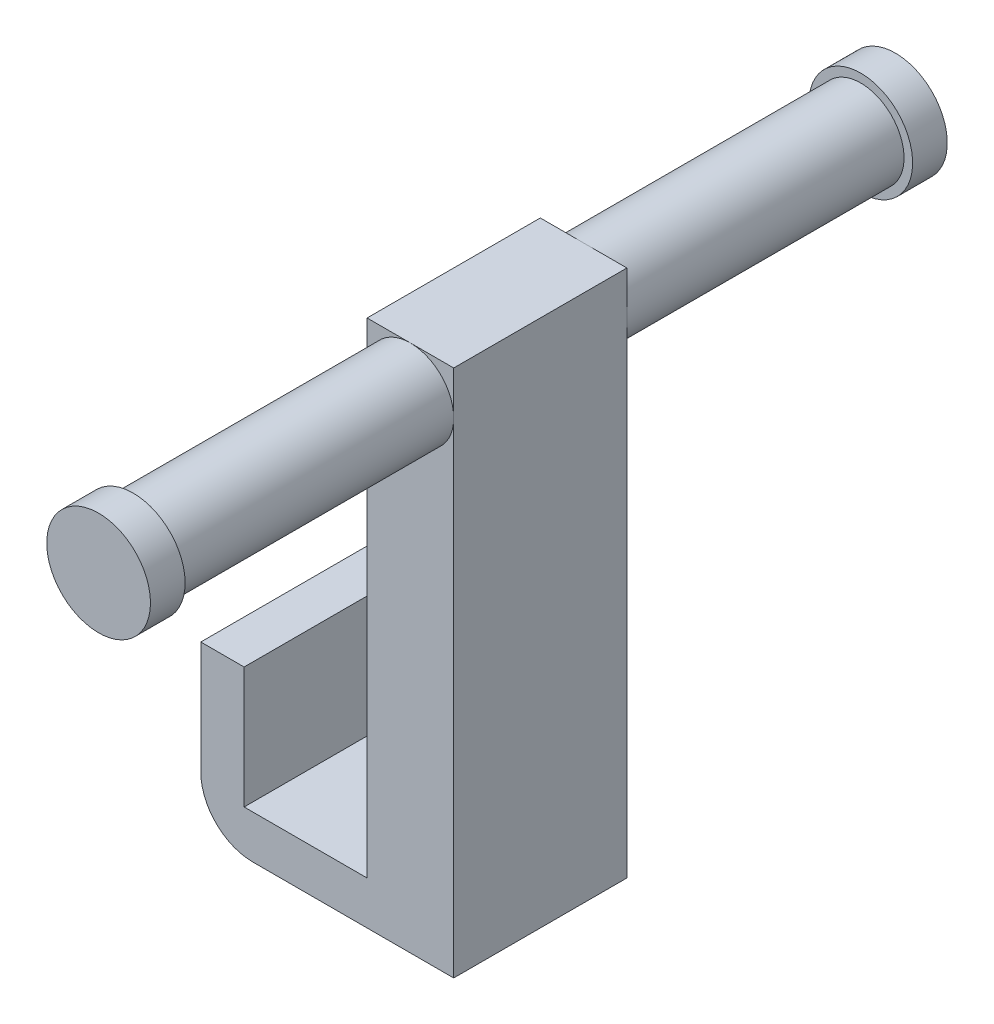
ISO-10303-21;
HEADER;
FILE_DESCRIPTION(('STEP AP214'),'2;1');
FILE_NAME('part.step','',(''),(''),'','','');
FILE_SCHEMA(('AUTOMOTIVE_DESIGN { 1 0 10303 214 1 1 1 1 }'));
ENDSEC;
DATA;
#1=APPLICATION_CONTEXT('core data for automotive mechanical design processes');
#2=APPLICATION_PROTOCOL_DEFINITION('international standard','automotive_design',2000,#1);
#3=PRODUCT_CONTEXT('',#1,'mechanical');
#4=PRODUCT('Part','Part','',(#3));
#5=PRODUCT_RELATED_PRODUCT_CATEGORY('part','',(#4));
#6=PRODUCT_DEFINITION_FORMATION('','',#4);
#7=PRODUCT_DEFINITION_CONTEXT('part definition',#1,'design');
#8=PRODUCT_DEFINITION('design','',#6,#7);
#9=PRODUCT_DEFINITION_SHAPE('','',#8);
#10=(LENGTH_UNIT() NAMED_UNIT(*) SI_UNIT(.MILLI.,.METRE.));
#11=(NAMED_UNIT(*) PLANE_ANGLE_UNIT() SI_UNIT($,.RADIAN.));
#12=(NAMED_UNIT(*) SI_UNIT($,.STERADIAN.) SOLID_ANGLE_UNIT());
#13=UNCERTAINTY_MEASURE_WITH_UNIT(LENGTH_MEASURE(1.E-05),#10,'distance_accuracy_value','');
#14=(GEOMETRIC_REPRESENTATION_CONTEXT(3) GLOBAL_UNCERTAINTY_ASSIGNED_CONTEXT((#13)) GLOBAL_UNIT_ASSIGNED_CONTEXT((#10,
#11,#12)) REPRESENTATION_CONTEXT('',''));
#15=CARTESIAN_POINT('',(0.,0.,0.));
#16=DIRECTION('',(0.,0.,1.));
#17=DIRECTION('',(1.,0.,0.));
#18=AXIS2_PLACEMENT_3D('',#15,#16,#17);
#19=CARTESIAN_POINT('',(7.3,1.76152304609218,1.77955911823647));
#20=DIRECTION('',(0.,0.,-1.));
#21=DIRECTION('',(-1.,0.,0.));
#22=AXIS2_PLACEMENT_3D('',#19,#20,#21);
#23=PLANE('',#22);
#24=CARTESIAN_POINT('',(6.05,14.5115230460922,1.77955911823647));
#25=DIRECTION('',(0.,0.,1.));
#26=DIRECTION('',(1.,0.,0.));
#27=AXIS2_PLACEMENT_3D('',#24,#25,#26);
#28=CIRCLE('',#27,1.25);
#29=CARTESIAN_POINT('',(7.3,14.5115230460922,1.77955911823647));
#30=VERTEX_POINT('',#29);
#31=CARTESIAN_POINT('',(6.05,15.7615230460922,1.77955911823647));
#32=VERTEX_POINT('',#31);
#33=EDGE_CURVE('E148',#30,#32,#28,.T.);
#34=ORIENTED_EDGE('',*,*,#33,.F.);
#35=DIRECTION('',(0.,-1.,0.));
#36=VECTOR('',#35,1.);
#37=CARTESIAN_POINT('',(7.3,1.76152304609218,1.77955911823647));
#38=LINE('',#37,#36);
#39=CARTESIAN_POINT('',(7.3,15.7615230460922,1.77955911823647));
#40=VERTEX_POINT('',#39);
#41=EDGE_CURVE('E126',#40,#30,#38,.T.);
#42=ORIENTED_EDGE('',*,*,#41,.F.);
#43=DIRECTION('',(1.,0.,0.));
#44=VECTOR('',#43,1.);
#45=CARTESIAN_POINT('',(7.3,15.7615230460922,1.77955911823647));
#46=LINE('',#45,#44);
#47=EDGE_CURVE('E149',#32,#40,#46,.T.);
#48=ORIENTED_EDGE('',*,*,#47,.F.);
#49=EDGE_LOOP('',(#34,#42,#48));
#50=FACE_BOUND('',#49,.T.);
#51=ADVANCED_FACE('F39',(#50),#23,.F.);
#52=CARTESIAN_POINT('',(4.8,14.5115230460922,1.77955911823647));
#53=VERTEX_POINT('',#52);
#54=EDGE_CURVE('E156',#32,#53,#28,.T.);
#55=ORIENTED_EDGE('',*,*,#54,.F.);
#56=CARTESIAN_POINT('',(4.8,15.7615230460922,1.77955911823647));
#57=VERTEX_POINT('',#56);
#58=EDGE_CURVE('E185',#57,#32,#46,.T.);
#59=ORIENTED_EDGE('',*,*,#58,.F.);
#60=DIRECTION('',(0.,-1.,0.));
#61=VECTOR('',#60,1.);
#62=CARTESIAN_POINT('',(4.8,15.7615230460922,1.77955911823647));
#63=LINE('',#62,#61);
#64=EDGE_CURVE('E190',#57,#53,#63,.T.);
#65=ORIENTED_EDGE('',*,*,#64,.T.);
#66=EDGE_LOOP('',(#55,#59,#65));
#67=FACE_BOUND('',#66,.T.);
#68=ADVANCED_FACE('F259',(#67),#23,.F.);
#69=CARTESIAN_POINT('',(7.3,1.76152304609218,-3.22044088176353));
#70=DIRECTION('',(0.,0.,1.));
#71=DIRECTION('',(1.,0.,0.));
#72=AXIS2_PLACEMENT_3D('',#69,#70,#71);
#73=PLANE('',#72);
#74=CARTESIAN_POINT('',(6.05,14.5115230460922,-3.22044088176353));
#75=DIRECTION('',(0.,0.,-1.));
#76=DIRECTION('',(-1.,0.,0.));
#77=AXIS2_PLACEMENT_3D('',#74,#75,#76);
#78=CIRCLE('',#77,1.25);
#79=CARTESIAN_POINT('',(4.8,14.5115230460922,-3.22044088176353));
#80=VERTEX_POINT('',#79);
#81=CARTESIAN_POINT('',(6.05,15.7615230460922,-3.22044088176353));
#82=VERTEX_POINT('',#81);
#83=EDGE_CURVE('E163',#80,#82,#78,.T.);
#84=ORIENTED_EDGE('',*,*,#83,.F.);
#85=DIRECTION('',(0.,-1.,0.));
#86=VECTOR('',#85,1.);
#87=CARTESIAN_POINT('',(4.8,15.7615230460922,-3.22044088176353));
#88=LINE('',#87,#86);
#89=CARTESIAN_POINT('',(4.8,15.7615230460922,-3.22044088176353));
#90=VERTEX_POINT('',#89);
#91=EDGE_CURVE('E194',#90,#80,#88,.T.);
#92=ORIENTED_EDGE('',*,*,#91,.F.);
#93=DIRECTION('',(-1.,0.,0.));
#94=VECTOR('',#93,1.);
#95=CARTESIAN_POINT('',(7.3,15.7615230460922,-3.22044088176353));
#96=LINE('',#95,#94);
#97=EDGE_CURVE('E179',#82,#90,#96,.T.);
#98=ORIENTED_EDGE('',*,*,#97,.F.);
#99=EDGE_LOOP('',(#84,#92,#98));
#100=FACE_BOUND('',#99,.T.);
#101=ADVANCED_FACE('F252',(#100),#73,.F.);
#102=CARTESIAN_POINT('',(7.3,14.5115230460922,-3.22044088176353));
#103=VERTEX_POINT('',#102);
#104=EDGE_CURVE('E158',#82,#103,#78,.T.);
#105=ORIENTED_EDGE('',*,*,#104,.F.);
#106=CARTESIAN_POINT('',(7.3,15.7615230460922,-3.22044088176353));
#107=VERTEX_POINT('',#106);
#108=EDGE_CURVE('E180',#107,#82,#96,.T.);
#109=ORIENTED_EDGE('',*,*,#108,.F.);
#110=DIRECTION('',(0.,1.,0.));
#111=VECTOR('',#110,1.);
#112=CARTESIAN_POINT('',(7.3,1.76152304609218,-3.22044088176353));
#113=LINE('',#112,#111);
#114=EDGE_CURVE('E217',#103,#107,#113,.T.);
#115=ORIENTED_EDGE('',*,*,#114,.F.);
#116=EDGE_LOOP('',(#105,#109,#115));
#117=FACE_BOUND('',#116,.T.);
#118=ADVANCED_FACE('F249',(#117),#73,.F.);
#119=CARTESIAN_POINT('',(7.3,1.76152304609218,1.77955911823647));
#120=DIRECTION('',(0.,-1.,0.));
#121=DIRECTION('',(0.,0.,-1.));
#122=AXIS2_PLACEMENT_3D('',#119,#120,#121);
#123=PLANE('',#122);
#124=DIRECTION('',(0.,0.,1.));
#125=VECTOR('',#124,1.);
#126=CARTESIAN_POINT('',(4.8,1.76152304609218,-3.22044088176353));
#127=LINE('',#126,#125);
#128=CARTESIAN_POINT('',(4.8,1.76152304609218,-3.22044088176353));
#129=VERTEX_POINT('',#128);
#130=CARTESIAN_POINT('',(4.8,1.76152304609218,1.77955911823647));
#131=VERTEX_POINT('',#130);
#132=EDGE_CURVE('E175',#129,#131,#127,.T.);
#133=ORIENTED_EDGE('',*,*,#132,.F.);
#134=DIRECTION('',(-1.,0.,0.));
#135=VECTOR('',#134,1.);
#136=CARTESIAN_POINT('',(7.3,1.76152304609218,-3.22044088176353));
#137=LINE('',#136,#135);
#138=CARTESIAN_POINT('',(1.25,1.76152304609218,-3.22044088176353));
#139=VERTEX_POINT('',#138);
#140=EDGE_CURVE('E225',#129,#139,#137,.T.);
#141=ORIENTED_EDGE('',*,*,#140,.T.);
#142=DIRECTION('',(0.,0.,-1.));
#143=VECTOR('',#142,1.);
#144=CARTESIAN_POINT('',(1.25,1.76152304609218,-3.22044088176353));
#145=LINE('',#144,#143);
#146=CARTESIAN_POINT('',(1.25,1.76152304609218,1.77955911823647));
#147=VERTEX_POINT('',#146);
#148=EDGE_CURVE('E196',#147,#139,#145,.T.);
#149=ORIENTED_EDGE('',*,*,#148,.F.);
#150=DIRECTION('',(-1.,0.,0.));
#151=VECTOR('',#150,1.);
#152=CARTESIAN_POINT('',(7.3,1.76152304609218,1.77955911823647));
#153=LINE('',#152,#151);
#154=EDGE_CURVE('E221',#131,#147,#153,.T.);
#155=ORIENTED_EDGE('',*,*,#154,.F.);
#156=EDGE_LOOP('',(#133,#141,#149,#155));
#157=FACE_BOUND('',#156,.T.);
#158=ADVANCED_FACE('F269',(#157),#123,.F.);
#159=DIRECTION('',(0.,-1.,0.));
#160=VECTOR('',#159,1.);
#161=CARTESIAN_POINT('',(0.,1.76152304609218,1.77955911823647));
#162=LINE('',#161,#160);
#163=CARTESIAN_POINT('',(0.,5.26152304609218,1.77955911823647));
#164=VERTEX_POINT('',#163);
#165=CARTESIAN_POINT('',(0.,2.01152304609218,1.77955911823647));
#166=VERTEX_POINT('',#165);
#167=EDGE_CURVE('E214',#164,#166,#162,.T.);
#168=ORIENTED_EDGE('',*,*,#167,.T.);
#169=CARTESIAN_POINT('',(1.5,2.01152304609218,1.77955911823647));
#170=DIRECTION('',(0.,0.,-1.));
#171=DIRECTION('',(-1.,0.,0.));
#172=AXIS2_PLACEMENT_3D('',#169,#170,#171);
#173=CIRCLE('',#172,1.5);
#174=CARTESIAN_POINT('',(1.5,0.511523046092185,1.77955911823647));
#175=VERTEX_POINT('',#174);
#176=EDGE_CURVE('E11',#166,#175,#173,.F.);
#177=ORIENTED_EDGE('',*,*,#176,.T.);
#178=DIRECTION('',(-1.,0.,0.));
#179=VECTOR('',#178,1.);
#180=CARTESIAN_POINT('',(7.3,0.511523046092185,1.77955911823647));
#181=LINE('',#180,#179);
#182=CARTESIAN_POINT('',(7.3,0.511523046092185,1.77955911823647));
#183=VERTEX_POINT('',#182);
#184=EDGE_CURVE('E145',#183,#175,#181,.T.);
#185=ORIENTED_EDGE('',*,*,#184,.F.);
#186=EDGE_CURVE('E129',#30,#183,#38,.T.);
#187=ORIENTED_EDGE('',*,*,#186,.F.);
#188=EDGE_CURVE('E142',#53,#30,#28,.T.);
#189=ORIENTED_EDGE('',*,*,#188,.F.);
#190=EDGE_CURVE('E187',#53,#131,#63,.T.);
#191=ORIENTED_EDGE('',*,*,#190,.T.);
#192=ORIENTED_EDGE('',*,*,#154,.T.);
#193=DIRECTION('',(0.,-1.,0.));
#194=VECTOR('',#193,1.);
#195=CARTESIAN_POINT('',(1.25,5.26152304609218,1.77955911823647));
#196=LINE('',#195,#194);
#197=CARTESIAN_POINT('',(1.25,5.26152304609218,1.77955911823647));
#198=VERTEX_POINT('',#197);
#199=EDGE_CURVE('E212',#198,#147,#196,.T.);
#200=ORIENTED_EDGE('',*,*,#199,.F.);
#201=DIRECTION('',(1.,0.,0.));
#202=VECTOR('',#201,1.);
#203=CARTESIAN_POINT('',(0.,5.26152304609218,1.77955911823647));
#204=LINE('',#203,#202);
#205=EDGE_CURVE('E200',#164,#198,#204,.T.);
#206=ORIENTED_EDGE('',*,*,#205,.F.);
#207=EDGE_LOOP('',(#168,#177,#185,#187,#189,#191,#192,#200,#206));
#208=FACE_BOUND('',#207,.T.);
#209=ADVANCED_FACE('F140',(#208),#23,.F.);
#210=CARTESIAN_POINT('',(7.3,0.511523046092185,1.77955911823647));
#211=DIRECTION('',(0.,1.,0.));
#212=DIRECTION('',(0.,0.,1.));
#213=AXIS2_PLACEMENT_3D('',#210,#211,#212);
#214=PLANE('',#213);
#215=ORIENTED_EDGE('',*,*,#184,.T.);
#216=DIRECTION('',(0.,0.,-1.));
#217=VECTOR('',#216,1.);
#218=CARTESIAN_POINT('',(1.5,0.511523046092185,1.77955911823647));
#219=LINE('',#218,#217);
#220=CARTESIAN_POINT('',(1.5,0.511523046092185,-3.22044088176353));
#221=VERTEX_POINT('',#220);
#222=EDGE_CURVE('E159',#175,#221,#219,.T.);
#223=ORIENTED_EDGE('',*,*,#222,.T.);
#224=DIRECTION('',(-1.,0.,0.));
#225=VECTOR('',#224,1.);
#226=CARTESIAN_POINT('',(7.3,0.511523046092185,-3.22044088176353));
#227=LINE('',#226,#225);
#228=CARTESIAN_POINT('',(7.3,0.511523046092185,-3.22044088176353));
#229=VERTEX_POINT('',#228);
#230=EDGE_CURVE('E227',#229,#221,#227,.T.);
#231=ORIENTED_EDGE('',*,*,#230,.F.);
#232=DIRECTION('',(0.,0.,-1.));
#233=VECTOR('',#232,1.);
#234=CARTESIAN_POINT('',(7.3,0.511523046092185,1.77955911823647));
#235=LINE('',#234,#233);
#236=EDGE_CURVE('E136',#183,#229,#235,.T.);
#237=ORIENTED_EDGE('',*,*,#236,.F.);
#238=EDGE_LOOP('',(#215,#223,#231,#237));
#239=FACE_BOUND('',#238,.T.);
#240=ADVANCED_FACE('F235',(#239),#214,.F.);
#241=ORIENTED_EDGE('',*,*,#230,.T.);
#242=CARTESIAN_POINT('',(1.5,2.01152304609218,-3.22044088176353));
#243=DIRECTION('',(0.,0.,1.));
#244=DIRECTION('',(1.,0.,0.));
#245=AXIS2_PLACEMENT_3D('',#242,#243,#244);
#246=CIRCLE('',#245,1.5);
#247=CARTESIAN_POINT('',(0.,2.01152304609218,-3.22044088176353));
#248=VERTEX_POINT('',#247);
#249=EDGE_CURVE('E61',#221,#248,#246,.F.);
#250=ORIENTED_EDGE('',*,*,#249,.T.);
#251=DIRECTION('',(0.,1.,0.));
#252=VECTOR('',#251,1.);
#253=CARTESIAN_POINT('',(0.,1.76152304609218,-3.22044088176353));
#254=LINE('',#253,#252);
#255=CARTESIAN_POINT('',(0.,5.26152304609218,-3.22044088176353));
#256=VERTEX_POINT('',#255);
#257=EDGE_CURVE('E146',#248,#256,#254,.T.);
#258=ORIENTED_EDGE('',*,*,#257,.T.);
#259=DIRECTION('',(-1.,0.,0.));
#260=VECTOR('',#259,1.);
#261=CARTESIAN_POINT('',(0.,5.26152304609218,-3.22044088176353));
#262=LINE('',#261,#260);
#263=CARTESIAN_POINT('',(1.25,5.26152304609218,-3.22044088176353));
#264=VERTEX_POINT('',#263);
#265=EDGE_CURVE('E204',#264,#256,#262,.T.);
#266=ORIENTED_EDGE('',*,*,#265,.F.);
#267=DIRECTION('',(0.,-1.,0.));
#268=VECTOR('',#267,1.);
#269=CARTESIAN_POINT('',(1.25,5.26152304609218,-3.22044088176353));
#270=LINE('',#269,#268);
#271=EDGE_CURVE('E207',#264,#139,#270,.T.);
#272=ORIENTED_EDGE('',*,*,#271,.T.);
#273=ORIENTED_EDGE('',*,*,#140,.F.);
#274=EDGE_CURVE('E193',#80,#129,#88,.T.);
#275=ORIENTED_EDGE('',*,*,#274,.F.);
#276=EDGE_CURVE('E161',#103,#80,#78,.T.);
#277=ORIENTED_EDGE('',*,*,#276,.F.);
#278=EDGE_CURVE('E218',#229,#103,#113,.T.);
#279=ORIENTED_EDGE('',*,*,#278,.F.);
#280=EDGE_LOOP('',(#241,#250,#258,#266,#272,#273,#275,#277,#279));
#281=FACE_BOUND('',#280,.T.);
#282=ADVANCED_FACE('F239',(#281),#73,.F.);
#283=CARTESIAN_POINT('',(7.3,0.,0.));
#284=DIRECTION('',(1.,0.,0.));
#285=DIRECTION('',(0.,0.,-1.));
#286=AXIS2_PLACEMENT_3D('',#283,#284,#285);
#287=PLANE('',#286);
#288=ORIENTED_EDGE('',*,*,#41,.T.);
#289=ORIENTED_EDGE('',*,*,#186,.T.);
#290=ORIENTED_EDGE('',*,*,#236,.T.);
#291=ORIENTED_EDGE('',*,*,#278,.T.);
#292=ORIENTED_EDGE('',*,*,#114,.T.);
#293=DIRECTION('',(0.,0.,-1.));
#294=VECTOR('',#293,1.);
#295=CARTESIAN_POINT('',(7.3,15.7615230460922,-3.22044088176353));
#296=LINE('',#295,#294);
#297=EDGE_CURVE('E132',#40,#107,#296,.T.);
#298=ORIENTED_EDGE('',*,*,#297,.F.);
#299=EDGE_LOOP('',(#288,#289,#290,#291,#292,#298));
#300=FACE_BOUND('',#299,.T.);
#301=ADVANCED_FACE('F128',(#300),#287,.T.);
#302=CARTESIAN_POINT('',(0.,0.,0.));
#303=DIRECTION('',(1.,0.,0.));
#304=DIRECTION('',(0.,0.,-1.));
#305=AXIS2_PLACEMENT_3D('',#302,#303,#304);
#306=PLANE('',#305);
#307=ORIENTED_EDGE('',*,*,#257,.F.);
#308=DIRECTION('',(0.,0.,-1.));
#309=VECTOR('',#308,1.);
#310=CARTESIAN_POINT('',(0.,2.01152304609218,0.));
#311=LINE('',#310,#309);
#312=EDGE_CURVE('E47',#248,#166,#311,.F.);
#313=ORIENTED_EDGE('',*,*,#312,.T.);
#314=ORIENTED_EDGE('',*,*,#167,.F.);
#315=DIRECTION('',(0.,0.,1.));
#316=VECTOR('',#315,1.);
#317=CARTESIAN_POINT('',(0.,5.26152304609218,-3.22044088176353));
#318=LINE('',#317,#316);
#319=EDGE_CURVE('E197',#256,#164,#318,.T.);
#320=ORIENTED_EDGE('',*,*,#319,.F.);
#321=EDGE_LOOP('',(#307,#313,#314,#320));
#322=FACE_BOUND('',#321,.T.);
#323=ADVANCED_FACE('F302',(#322),#306,.F.);
#324=CARTESIAN_POINT('',(1.25,5.26152304609218,-3.22044088176353));
#325=DIRECTION('',(-1.,0.,0.));
#326=DIRECTION('',(0.,0.,1.));
#327=AXIS2_PLACEMENT_3D('',#324,#325,#326);
#328=PLANE('',#327);
#329=ORIENTED_EDGE('',*,*,#148,.T.);
#330=ORIENTED_EDGE('',*,*,#271,.F.);
#331=DIRECTION('',(0.,0.,-1.));
#332=VECTOR('',#331,1.);
#333=CARTESIAN_POINT('',(1.25,5.26152304609218,-3.22044088176353));
#334=LINE('',#333,#332);
#335=EDGE_CURVE('E202',#198,#264,#334,.T.);
#336=ORIENTED_EDGE('',*,*,#335,.F.);
#337=ORIENTED_EDGE('',*,*,#199,.T.);
#338=EDGE_LOOP('',(#329,#330,#336,#337));
#339=FACE_BOUND('',#338,.T.);
#340=ADVANCED_FACE('F273',(#339),#328,.F.);
#341=CARTESIAN_POINT('',(0.,5.26152304609218,0.));
#342=DIRECTION('',(0.,1.,0.));
#343=DIRECTION('',(0.,0.,1.));
#344=AXIS2_PLACEMENT_3D('',#341,#342,#343);
#345=PLANE('',#344);
#346=ORIENTED_EDGE('',*,*,#319,.T.);
#347=ORIENTED_EDGE('',*,*,#205,.T.);
#348=ORIENTED_EDGE('',*,*,#335,.T.);
#349=ORIENTED_EDGE('',*,*,#265,.T.);
#350=EDGE_LOOP('',(#346,#347,#348,#349));
#351=FACE_BOUND('',#350,.T.);
#352=ADVANCED_FACE('F276',(#351),#345,.T.);
#353=CARTESIAN_POINT('',(4.8,15.7615230460922,-3.22044088176353));
#354=DIRECTION('',(1.,0.,0.));
#355=DIRECTION('',(0.,0.,-1.));
#356=AXIS2_PLACEMENT_3D('',#353,#354,#355);
#357=PLANE('',#356);
#358=ORIENTED_EDGE('',*,*,#132,.T.);
#359=ORIENTED_EDGE('',*,*,#190,.F.);
#360=ORIENTED_EDGE('',*,*,#64,.F.);
#361=DIRECTION('',(0.,0.,1.));
#362=VECTOR('',#361,1.);
#363=CARTESIAN_POINT('',(4.8,15.7615230460922,-3.22044088176353));
#364=LINE('',#363,#362);
#365=EDGE_CURVE('E183',#90,#57,#364,.T.);
#366=ORIENTED_EDGE('',*,*,#365,.F.);
#367=ORIENTED_EDGE('',*,*,#91,.T.);
#368=ORIENTED_EDGE('',*,*,#274,.T.);
#369=EDGE_LOOP('',(#358,#359,#360,#366,#367,#368));
#370=FACE_BOUND('',#369,.T.);
#371=ADVANCED_FACE('F261',(#370),#357,.F.);
#372=CARTESIAN_POINT('',(0.,15.7615230460922,0.));
#373=DIRECTION('',(0.,-1.,0.));
#374=DIRECTION('',(0.,0.,-1.));
#375=AXIS2_PLACEMENT_3D('',#372,#373,#374);
#376=PLANE('',#375);
#377=ORIENTED_EDGE('',*,*,#297,.T.);
#378=ORIENTED_EDGE('',*,*,#108,.T.);
#379=ORIENTED_EDGE('',*,*,#97,.T.);
#380=ORIENTED_EDGE('',*,*,#365,.T.);
#381=ORIENTED_EDGE('',*,*,#58,.T.);
#382=ORIENTED_EDGE('',*,*,#47,.T.);
#383=EDGE_LOOP('',(#377,#378,#379,#380,#381,#382));
#384=FACE_BOUND('',#383,.T.);
#385=ADVANCED_FACE('F255',(#384),#376,.F.);
#386=CARTESIAN_POINT('',(6.05,14.5115230460922,-11.2204408817635));
#387=DIRECTION('',(0.,0.,1.));
#388=DIRECTION('',(1.,0.,0.));
#389=AXIS2_PLACEMENT_3D('',#386,#387,#388);
#390=CYLINDRICAL_SURFACE('',#389,1.25);
#391=CARTESIAN_POINT('',(6.05,14.5115230460922,-11.2204408817635));
#392=DIRECTION('',(0.,0.,-1.));
#393=DIRECTION('',(-1.,0.,0.));
#394=AXIS2_PLACEMENT_3D('',#391,#392,#393);
#395=CIRCLE('',#394,1.25);
#396=CARTESIAN_POINT('',(4.8,14.5115230460922,-11.2204408817635));
#397=VERTEX_POINT('',#396);
#398=EDGE_CURVE('E173',#397,#397,#395,.T.);
#399=ORIENTED_EDGE('',*,*,#398,.F.);
#400=EDGE_LOOP('',(#399));
#401=FACE_BOUND('',#400,.T.);
#402=ORIENTED_EDGE('',*,*,#83,.T.);
#403=ORIENTED_EDGE('',*,*,#104,.T.);
#404=ORIENTED_EDGE('',*,*,#276,.T.);
#405=EDGE_LOOP('',(#402,#403,#404));
#406=FACE_BOUND('',#405,.T.);
#407=ADVANCED_FACE('F245',(#401,#406),#390,.T.);
#408=CARTESIAN_POINT('',(6.05,14.5115230460922,-12.2204408817635));
#409=DIRECTION('',(0.,0.,1.));
#410=DIRECTION('',(1.,0.,0.));
#411=AXIS2_PLACEMENT_3D('',#408,#409,#410);
#412=CYLINDRICAL_SURFACE('',#411,1.49705526044862);
#413=CARTESIAN_POINT('',(6.05,14.5115230460922,-12.2204408817635));
#414=DIRECTION('',(0.,0.,-1.));
#415=DIRECTION('',(-1.,0.,0.));
#416=AXIS2_PLACEMENT_3D('',#413,#414,#415);
#417=CIRCLE('',#416,1.49705526044862);
#418=CARTESIAN_POINT('',(4.55294473955137,14.5115230460922,-12.2204408817635));
#419=VERTEX_POINT('',#418);
#420=EDGE_CURVE('E167',#419,#419,#417,.T.);
#421=ORIENTED_EDGE('',*,*,#420,.F.);
#422=EDGE_LOOP('',(#421));
#423=FACE_BOUND('',#422,.T.);
#424=CARTESIAN_POINT('',(6.05,14.5115230460922,-11.2204408817635));
#425=DIRECTION('',(0.,0.,-1.));
#426=DIRECTION('',(-1.,0.,0.));
#427=AXIS2_PLACEMENT_3D('',#424,#425,#426);
#428=CIRCLE('',#427,1.49705526044862);
#429=CARTESIAN_POINT('',(4.55294473955137,14.5115230460922,-11.2204408817635));
#430=VERTEX_POINT('',#429);
#431=EDGE_CURVE('E170',#430,#430,#428,.T.);
#432=ORIENTED_EDGE('',*,*,#431,.T.);
#433=EDGE_LOOP('',(#432));
#434=FACE_BOUND('',#433,.T.);
#435=ADVANCED_FACE('F328',(#423,#434),#412,.T.);
#436=CARTESIAN_POINT('',(6.05,14.5115230460922,-12.2204408817635));
#437=DIRECTION('',(0.,0.,-1.));
#438=DIRECTION('',(-1.,0.,0.));
#439=AXIS2_PLACEMENT_3D('',#436,#437,#438);
#440=PLANE('',#439);
#441=ORIENTED_EDGE('',*,*,#420,.T.);
#442=EDGE_LOOP('',(#441));
#443=FACE_BOUND('',#442,.T.);
#444=ADVANCED_FACE('F340',(#443),#440,.T.);
#445=CARTESIAN_POINT('',(6.05,14.5115230460922,-11.2204408817635));
#446=DIRECTION('',(0.,0.,-1.));
#447=DIRECTION('',(-1.,0.,0.));
#448=AXIS2_PLACEMENT_3D('',#445,#446,#447);
#449=PLANE('',#448);
#450=ORIENTED_EDGE('',*,*,#398,.T.);
#451=EDGE_LOOP('',(#450));
#452=FACE_BOUND('',#451,.T.);
#453=ORIENTED_EDGE('',*,*,#431,.F.);
#454=EDGE_LOOP('',(#453));
#455=FACE_BOUND('',#454,.T.);
#456=ADVANCED_FACE('F351',(#452,#455),#449,.F.);
#457=CARTESIAN_POINT('',(6.05,14.5115230460922,9.77955911823647));
#458=DIRECTION('',(0.,0.,-1.));
#459=DIRECTION('',(-1.,0.,0.));
#460=AXIS2_PLACEMENT_3D('',#457,#458,#459);
#461=CYLINDRICAL_SURFACE('',#460,1.25);
#462=CARTESIAN_POINT('',(6.05,14.5115230460922,9.77955911823647));
#463=DIRECTION('',(0.,0.,1.));
#464=DIRECTION('',(1.,0.,0.));
#465=AXIS2_PLACEMENT_3D('',#462,#463,#464);
#466=CIRCLE('',#465,1.25);
#467=CARTESIAN_POINT('',(7.3,14.5115230460922,9.77955911823647));
#468=VERTEX_POINT('',#467);
#469=EDGE_CURVE('E153',#468,#468,#466,.T.);
#470=ORIENTED_EDGE('',*,*,#469,.F.);
#471=EDGE_LOOP('',(#470));
#472=FACE_BOUND('',#471,.T.);
#473=ORIENTED_EDGE('',*,*,#33,.T.);
#474=ORIENTED_EDGE('',*,*,#54,.T.);
#475=ORIENTED_EDGE('',*,*,#188,.T.);
#476=EDGE_LOOP('',(#473,#474,#475));
#477=FACE_BOUND('',#476,.T.);
#478=ADVANCED_FACE('F157',(#472,#477),#461,.T.);
#479=CARTESIAN_POINT('',(6.05,14.5115230460922,10.7795591182365));
#480=DIRECTION('',(0.,0.,-1.));
#481=DIRECTION('',(-1.,0.,0.));
#482=AXIS2_PLACEMENT_3D('',#479,#480,#481);
#483=CYLINDRICAL_SURFACE('',#482,1.49705526044862);
#484=CARTESIAN_POINT('',(6.05,14.5115230460922,10.7795591182365));
#485=DIRECTION('',(0.,0.,1.));
#486=DIRECTION('',(1.,0.,0.));
#487=AXIS2_PLACEMENT_3D('',#484,#485,#486);
#488=CIRCLE('',#487,1.49705526044862);
#489=CARTESIAN_POINT('',(7.54705526044862,14.5115230460922,10.7795591182365));
#490=VERTEX_POINT('',#489);
#491=EDGE_CURVE('E154',#490,#490,#488,.T.);
#492=ORIENTED_EDGE('',*,*,#491,.F.);
#493=EDGE_LOOP('',(#492));
#494=FACE_BOUND('',#493,.T.);
#495=CARTESIAN_POINT('',(6.05,14.5115230460922,9.77955911823647));
#496=DIRECTION('',(0.,0.,1.));
#497=DIRECTION('',(1.,0.,0.));
#498=AXIS2_PLACEMENT_3D('',#495,#496,#497);
#499=CIRCLE('',#498,1.49705526044862);
#500=CARTESIAN_POINT('',(7.54705526044862,14.5115230460922,9.77955911823647));
#501=VERTEX_POINT('',#500);
#502=EDGE_CURVE('E541',#501,#501,#499,.T.);
#503=ORIENTED_EDGE('',*,*,#502,.T.);
#504=EDGE_LOOP('',(#503));
#505=FACE_BOUND('',#504,.T.);
#506=ADVANCED_FACE('F410',(#494,#505),#483,.T.);
#507=CARTESIAN_POINT('',(6.05,14.5115230460922,10.7795591182365));
#508=DIRECTION('',(0.,0.,1.));
#509=DIRECTION('',(1.,0.,0.));
#510=AXIS2_PLACEMENT_3D('',#507,#508,#509);
#511=PLANE('',#510);
#512=ORIENTED_EDGE('',*,*,#491,.T.);
#513=EDGE_LOOP('',(#512));
#514=FACE_BOUND('',#513,.T.);
#515=ADVANCED_FACE('F283',(#514),#511,.T.);
#516=CARTESIAN_POINT('',(6.05,14.5115230460922,9.77955911823647));
#517=DIRECTION('',(0.,0.,1.));
#518=DIRECTION('',(1.,0.,0.));
#519=AXIS2_PLACEMENT_3D('',#516,#517,#518);
#520=PLANE('',#519);
#521=ORIENTED_EDGE('',*,*,#469,.T.);
#522=EDGE_LOOP('',(#521));
#523=FACE_BOUND('',#522,.T.);
#524=ORIENTED_EDGE('',*,*,#502,.F.);
#525=EDGE_LOOP('',(#524));
#526=FACE_BOUND('',#525,.T.);
#527=ADVANCED_FACE('F279',(#523,#526),#520,.F.);
#528=CARTESIAN_POINT('',(1.5,2.01152304609218,1.77955911823647));
#529=DIRECTION('',(0.,0.,-1.));
#530=DIRECTION('',(-1.,0.,0.));
#531=AXIS2_PLACEMENT_3D('',#528,#529,#530);
#532=CYLINDRICAL_SURFACE('',#531,1.5);
#533=ORIENTED_EDGE('',*,*,#176,.F.);
#534=ORIENTED_EDGE('',*,*,#312,.F.);
#535=ORIENTED_EDGE('',*,*,#249,.F.);
#536=ORIENTED_EDGE('',*,*,#222,.F.);
#537=EDGE_LOOP('',(#533,#534,#535,#536));
#538=FACE_BOUND('',#537,.T.);
#539=ADVANCED_FACE('F41',(#538),#532,.T.);
#540=CLOSED_SHELL('',(#51,#68,#101,#118,#158,#209,#240,#282,#301,#323,#340,#352,#371,#385,#407,
#435,#444,#456,#478,#506,#515,#527,#539));
#541=MANIFOLD_SOLID_BREP('B2',#540);
#542=ADVANCED_BREP_SHAPE_REPRESENTATION('',(#18,#541),#14);
#543=SHAPE_DEFINITION_REPRESENTATION(#9,#542);
ENDSEC;
END-ISO-10303-21;
